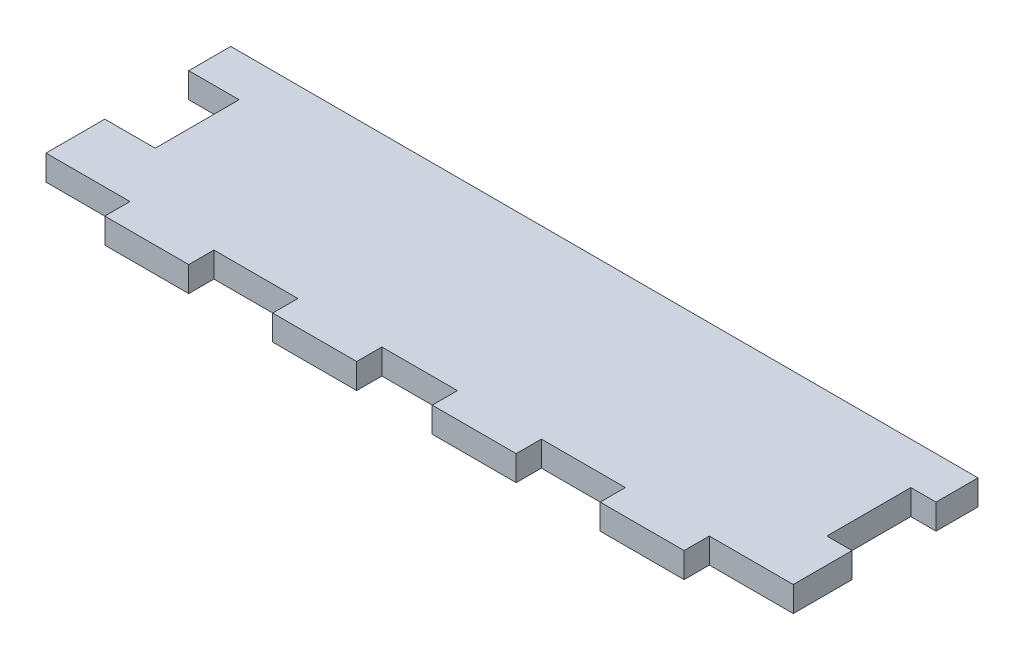
ISO-10303-21;
HEADER;
FILE_DESCRIPTION(('STEP AP214'),'2;1');
FILE_NAME('part.step','',(''),(''),'','','');
FILE_SCHEMA(('AUTOMOTIVE_DESIGN { 1 0 10303 214 1 1 1 1 }'));
ENDSEC;
DATA;
#1=APPLICATION_CONTEXT('core data for automotive mechanical design processes');
#2=APPLICATION_PROTOCOL_DEFINITION('international standard','automotive_design',2000,#1);
#3=PRODUCT_CONTEXT('',#1,'mechanical');
#4=PRODUCT('Part','Part','',(#3));
#5=PRODUCT_RELATED_PRODUCT_CATEGORY('part','',(#4));
#6=PRODUCT_DEFINITION_FORMATION('','',#4);
#7=PRODUCT_DEFINITION_CONTEXT('part definition',#1,'design');
#8=PRODUCT_DEFINITION('design','',#6,#7);
#9=PRODUCT_DEFINITION_SHAPE('','',#8);
#10=(LENGTH_UNIT() NAMED_UNIT(*) SI_UNIT(.MILLI.,.METRE.));
#11=(NAMED_UNIT(*) PLANE_ANGLE_UNIT() SI_UNIT($,.RADIAN.));
#12=(NAMED_UNIT(*) SI_UNIT($,.STERADIAN.) SOLID_ANGLE_UNIT());
#13=UNCERTAINTY_MEASURE_WITH_UNIT(LENGTH_MEASURE(1.E-05),#10,'distance_accuracy_value','');
#14=(GEOMETRIC_REPRESENTATION_CONTEXT(3) GLOBAL_UNCERTAINTY_ASSIGNED_CONTEXT((#13)) GLOBAL_UNIT_ASSIGNED_CONTEXT((#10,
#11,#12)) REPRESENTATION_CONTEXT('',''));
#15=CARTESIAN_POINT('',(0.,0.,0.));
#16=DIRECTION('',(0.,0.,1.));
#17=DIRECTION('',(1.,0.,0.));
#18=AXIS2_PLACEMENT_3D('',#15,#16,#17);
#19=CARTESIAN_POINT('',(0.,3.,0.));
#20=DIRECTION('',(1.,0.,0.));
#21=DIRECTION('',(0.,0.,-1.));
#22=AXIS2_PLACEMENT_3D('',#19,#20,#21);
#23=PLANE('',#22);
#24=DIRECTION('',(0.,0.,1.));
#25=VECTOR('',#24,1.);
#26=CARTESIAN_POINT('',(0.,0.,0.));
#27=LINE('',#26,#25);
#28=CARTESIAN_POINT('',(0.,0.,-7.));
#29=VERTEX_POINT('',#28);
#30=CARTESIAN_POINT('',(0.,0.,0.));
#31=VERTEX_POINT('',#30);
#32=EDGE_CURVE('E248',#29,#31,#27,.T.);
#33=ORIENTED_EDGE('',*,*,#32,.T.);
#34=DIRECTION('',(0.,-1.,0.));
#35=VECTOR('',#34,1.);
#36=CARTESIAN_POINT('',(0.,3.,0.));
#37=LINE('',#36,#35);
#38=CARTESIAN_POINT('',(0.,3.,0.));
#39=VERTEX_POINT('',#38);
#40=EDGE_CURVE('E11',#39,#31,#37,.T.);
#41=ORIENTED_EDGE('',*,*,#40,.F.);
#42=DIRECTION('',(0.,0.,1.));
#43=VECTOR('',#42,1.);
#44=CARTESIAN_POINT('',(0.,3.,0.));
#45=LINE('',#44,#43);
#46=CARTESIAN_POINT('',(0.,3.,-7.));
#47=VERTEX_POINT('',#46);
#48=EDGE_CURVE('E302',#47,#39,#45,.T.);
#49=ORIENTED_EDGE('',*,*,#48,.F.);
#50=DIRECTION('',(0.,-1.,0.));
#51=VECTOR('',#50,1.);
#52=CARTESIAN_POINT('',(0.,3.,-7.));
#53=LINE('',#52,#51);
#54=EDGE_CURVE('E244',#47,#29,#53,.T.);
#55=ORIENTED_EDGE('',*,*,#54,.T.);
#56=EDGE_LOOP('',(#33,#41,#49,#55));
#57=FACE_BOUND('',#56,.T.);
#58=ADVANCED_FACE('F32',(#57),#23,.F.);
#59=CARTESIAN_POINT('',(0.,3.,0.));
#60=DIRECTION('',(0.,0.,-1.));
#61=DIRECTION('',(-1.,0.,0.));
#62=AXIS2_PLACEMENT_3D('',#59,#60,#61);
#63=PLANE('',#62);
#64=DIRECTION('',(1.,0.,0.));
#65=VECTOR('',#64,1.);
#66=CARTESIAN_POINT('',(0.,0.,0.));
#67=LINE('',#66,#65);
#68=CARTESIAN_POINT('',(10.,0.,0.));
#69=VERTEX_POINT('',#68);
#70=EDGE_CURVE('E251',#31,#69,#67,.T.);
#71=ORIENTED_EDGE('',*,*,#70,.T.);
#72=DIRECTION('',(0.,-1.,0.));
#73=VECTOR('',#72,1.);
#74=CARTESIAN_POINT('',(10.,3.,0.));
#75=LINE('',#74,#73);
#76=CARTESIAN_POINT('',(10.,3.,0.));
#77=VERTEX_POINT('',#76);
#78=EDGE_CURVE('E40',#77,#69,#75,.T.);
#79=ORIENTED_EDGE('',*,*,#78,.F.);
#80=DIRECTION('',(1.,0.,0.));
#81=VECTOR('',#80,1.);
#82=CARTESIAN_POINT('',(0.,3.,0.));
#83=LINE('',#82,#81);
#84=EDGE_CURVE('E151',#39,#77,#83,.T.);
#85=ORIENTED_EDGE('',*,*,#84,.F.);
#86=ORIENTED_EDGE('',*,*,#40,.T.);
#87=EDGE_LOOP('',(#71,#79,#85,#86));
#88=FACE_BOUND('',#87,.T.);
#89=ADVANCED_FACE('F460',(#88),#63,.F.);
#90=CARTESIAN_POINT('',(10.,3.,0.));
#91=DIRECTION('',(1.,0.,0.));
#92=DIRECTION('',(0.,0.,-1.));
#93=AXIS2_PLACEMENT_3D('',#90,#91,#92);
#94=PLANE('',#93);
#95=DIRECTION('',(0.,0.,1.));
#96=VECTOR('',#95,1.);
#97=CARTESIAN_POINT('',(10.,0.,0.));
#98=LINE('',#97,#96);
#99=CARTESIAN_POINT('',(10.,0.,3.));
#100=VERTEX_POINT('',#99);
#101=EDGE_CURVE('E253',#69,#100,#98,.T.);
#102=ORIENTED_EDGE('',*,*,#101,.T.);
#103=DIRECTION('',(0.,-1.,0.));
#104=VECTOR('',#103,1.);
#105=CARTESIAN_POINT('',(10.,3.,3.));
#106=LINE('',#105,#104);
#107=CARTESIAN_POINT('',(10.,3.,3.));
#108=VERTEX_POINT('',#107);
#109=EDGE_CURVE('E369',#108,#100,#106,.T.);
#110=ORIENTED_EDGE('',*,*,#109,.F.);
#111=DIRECTION('',(0.,0.,1.));
#112=VECTOR('',#111,1.);
#113=CARTESIAN_POINT('',(10.,3.,0.));
#114=LINE('',#113,#112);
#115=EDGE_CURVE('E377',#77,#108,#114,.T.);
#116=ORIENTED_EDGE('',*,*,#115,.F.);
#117=ORIENTED_EDGE('',*,*,#78,.T.);
#118=EDGE_LOOP('',(#102,#110,#116,#117));
#119=FACE_BOUND('',#118,.T.);
#120=ADVANCED_FACE('F375',(#119),#94,.F.);
#121=CARTESIAN_POINT('',(10.,3.,3.));
#122=DIRECTION('',(0.,0.,-1.));
#123=DIRECTION('',(-1.,0.,0.));
#124=AXIS2_PLACEMENT_3D('',#121,#122,#123);
#125=PLANE('',#124);
#126=DIRECTION('',(1.,0.,0.));
#127=VECTOR('',#126,1.);
#128=CARTESIAN_POINT('',(10.,0.,3.));
#129=LINE('',#128,#127);
#130=CARTESIAN_POINT('',(20.,0.,3.));
#131=VERTEX_POINT('',#130);
#132=EDGE_CURVE('E255',#100,#131,#129,.T.);
#133=ORIENTED_EDGE('',*,*,#132,.T.);
#134=DIRECTION('',(0.,-1.,0.));
#135=VECTOR('',#134,1.);
#136=CARTESIAN_POINT('',(20.,3.,3.));
#137=LINE('',#136,#135);
#138=CARTESIAN_POINT('',(20.,3.,3.));
#139=VERTEX_POINT('',#138);
#140=EDGE_CURVE('E366',#139,#131,#137,.T.);
#141=ORIENTED_EDGE('',*,*,#140,.F.);
#142=DIRECTION('',(1.,0.,0.));
#143=VECTOR('',#142,1.);
#144=CARTESIAN_POINT('',(10.,3.,3.));
#145=LINE('',#144,#143);
#146=EDGE_CURVE('E395',#108,#139,#145,.T.);
#147=ORIENTED_EDGE('',*,*,#146,.F.);
#148=ORIENTED_EDGE('',*,*,#109,.T.);
#149=EDGE_LOOP('',(#133,#141,#147,#148));
#150=FACE_BOUND('',#149,.T.);
#151=ADVANCED_FACE('F386',(#150),#125,.F.);
#152=CARTESIAN_POINT('',(20.,3.,0.));
#153=DIRECTION('',(-1.,0.,0.));
#154=DIRECTION('',(0.,0.,1.));
#155=AXIS2_PLACEMENT_3D('',#152,#153,#154);
#156=PLANE('',#155);
#157=DIRECTION('',(0.,0.,-1.));
#158=VECTOR('',#157,1.);
#159=CARTESIAN_POINT('',(20.,0.,0.));
#160=LINE('',#159,#158);
#161=CARTESIAN_POINT('',(20.,0.,0.));
#162=VERTEX_POINT('',#161);
#163=EDGE_CURVE('E257',#131,#162,#160,.T.);
#164=ORIENTED_EDGE('',*,*,#163,.T.);
#165=DIRECTION('',(0.,-1.,0.));
#166=VECTOR('',#165,1.);
#167=CARTESIAN_POINT('',(20.,3.,0.));
#168=LINE('',#167,#166);
#169=CARTESIAN_POINT('',(20.,3.,0.));
#170=VERTEX_POINT('',#169);
#171=EDGE_CURVE('E363',#170,#162,#168,.T.);
#172=ORIENTED_EDGE('',*,*,#171,.F.);
#173=DIRECTION('',(0.,0.,-1.));
#174=VECTOR('',#173,1.);
#175=CARTESIAN_POINT('',(20.,3.,0.));
#176=LINE('',#175,#174);
#177=EDGE_CURVE('E392',#139,#170,#176,.T.);
#178=ORIENTED_EDGE('',*,*,#177,.F.);
#179=ORIENTED_EDGE('',*,*,#140,.T.);
#180=EDGE_LOOP('',(#164,#172,#178,#179));
#181=FACE_BOUND('',#180,.T.);
#182=ADVANCED_FACE('F390',(#181),#156,.F.);
#183=CARTESIAN_POINT('',(20.,3.,0.));
#184=DIRECTION('',(0.,0.,-1.));
#185=DIRECTION('',(-1.,0.,0.));
#186=AXIS2_PLACEMENT_3D('',#183,#184,#185);
#187=PLANE('',#186);
#188=DIRECTION('',(1.,0.,0.));
#189=VECTOR('',#188,1.);
#190=CARTESIAN_POINT('',(20.,0.,0.));
#191=LINE('',#190,#189);
#192=CARTESIAN_POINT('',(30.,0.,0.));
#193=VERTEX_POINT('',#192);
#194=EDGE_CURVE('E259',#162,#193,#191,.T.);
#195=ORIENTED_EDGE('',*,*,#194,.T.);
#196=DIRECTION('',(0.,-1.,0.));
#197=VECTOR('',#196,1.);
#198=CARTESIAN_POINT('',(30.,3.,0.));
#199=LINE('',#198,#197);
#200=CARTESIAN_POINT('',(30.,3.,0.));
#201=VERTEX_POINT('',#200);
#202=EDGE_CURVE('E360',#201,#193,#199,.T.);
#203=ORIENTED_EDGE('',*,*,#202,.F.);
#204=DIRECTION('',(1.,0.,0.));
#205=VECTOR('',#204,1.);
#206=CARTESIAN_POINT('',(20.,3.,0.));
#207=LINE('',#206,#205);
#208=EDGE_CURVE('E394',#170,#201,#207,.T.);
#209=ORIENTED_EDGE('',*,*,#208,.F.);
#210=ORIENTED_EDGE('',*,*,#171,.T.);
#211=EDGE_LOOP('',(#195,#203,#209,#210));
#212=FACE_BOUND('',#211,.T.);
#213=ADVANCED_FACE('F473',(#212),#187,.F.);
#214=CARTESIAN_POINT('',(30.,3.,0.));
#215=DIRECTION('',(1.,0.,0.));
#216=DIRECTION('',(0.,0.,-1.));
#217=AXIS2_PLACEMENT_3D('',#214,#215,#216);
#218=PLANE('',#217);
#219=DIRECTION('',(0.,0.,1.));
#220=VECTOR('',#219,1.);
#221=CARTESIAN_POINT('',(30.,0.,0.));
#222=LINE('',#221,#220);
#223=CARTESIAN_POINT('',(30.,0.,3.));
#224=VERTEX_POINT('',#223);
#225=EDGE_CURVE('E261',#193,#224,#222,.T.);
#226=ORIENTED_EDGE('',*,*,#225,.T.);
#227=DIRECTION('',(0.,-1.,0.));
#228=VECTOR('',#227,1.);
#229=CARTESIAN_POINT('',(30.,3.,3.));
#230=LINE('',#229,#228);
#231=CARTESIAN_POINT('',(30.,3.,3.));
#232=VERTEX_POINT('',#231);
#233=EDGE_CURVE('E357',#232,#224,#230,.T.);
#234=ORIENTED_EDGE('',*,*,#233,.F.);
#235=DIRECTION('',(0.,0.,1.));
#236=VECTOR('',#235,1.);
#237=CARTESIAN_POINT('',(30.,3.,0.));
#238=LINE('',#237,#236);
#239=EDGE_CURVE('E397',#201,#232,#238,.T.);
#240=ORIENTED_EDGE('',*,*,#239,.F.);
#241=ORIENTED_EDGE('',*,*,#202,.T.);
#242=EDGE_LOOP('',(#226,#234,#240,#241));
#243=FACE_BOUND('',#242,.T.);
#244=ADVANCED_FACE('F476',(#243),#218,.F.);
#245=CARTESIAN_POINT('',(30.,3.,3.));
#246=DIRECTION('',(0.,0.,-1.));
#247=DIRECTION('',(-1.,0.,0.));
#248=AXIS2_PLACEMENT_3D('',#245,#246,#247);
#249=PLANE('',#248);
#250=DIRECTION('',(1.,0.,0.));
#251=VECTOR('',#250,1.);
#252=CARTESIAN_POINT('',(30.,0.,3.));
#253=LINE('',#252,#251);
#254=CARTESIAN_POINT('',(40.,0.,3.));
#255=VERTEX_POINT('',#254);
#256=EDGE_CURVE('E263',#224,#255,#253,.T.);
#257=ORIENTED_EDGE('',*,*,#256,.T.);
#258=DIRECTION('',(0.,-1.,0.));
#259=VECTOR('',#258,1.);
#260=CARTESIAN_POINT('',(40.,3.,3.));
#261=LINE('',#260,#259);
#262=CARTESIAN_POINT('',(40.,3.,3.));
#263=VERTEX_POINT('',#262);
#264=EDGE_CURVE('E354',#263,#255,#261,.T.);
#265=ORIENTED_EDGE('',*,*,#264,.F.);
#266=DIRECTION('',(1.,0.,0.));
#267=VECTOR('',#266,1.);
#268=CARTESIAN_POINT('',(30.,3.,3.));
#269=LINE('',#268,#267);
#270=EDGE_CURVE('E403',#232,#263,#269,.T.);
#271=ORIENTED_EDGE('',*,*,#270,.F.);
#272=ORIENTED_EDGE('',*,*,#233,.T.);
#273=EDGE_LOOP('',(#257,#265,#271,#272));
#274=FACE_BOUND('',#273,.T.);
#275=ADVANCED_FACE('F480',(#274),#249,.F.);
#276=CARTESIAN_POINT('',(40.,3.,0.));
#277=DIRECTION('',(-1.,0.,0.));
#278=DIRECTION('',(0.,0.,1.));
#279=AXIS2_PLACEMENT_3D('',#276,#277,#278);
#280=PLANE('',#279);
#281=DIRECTION('',(0.,0.,-1.));
#282=VECTOR('',#281,1.);
#283=CARTESIAN_POINT('',(40.,0.,0.));
#284=LINE('',#283,#282);
#285=CARTESIAN_POINT('',(40.,0.,0.));
#286=VERTEX_POINT('',#285);
#287=EDGE_CURVE('E265',#255,#286,#284,.T.);
#288=ORIENTED_EDGE('',*,*,#287,.T.);
#289=DIRECTION('',(0.,-1.,0.));
#290=VECTOR('',#289,1.);
#291=CARTESIAN_POINT('',(40.,3.,0.));
#292=LINE('',#291,#290);
#293=CARTESIAN_POINT('',(40.,3.,0.));
#294=VERTEX_POINT('',#293);
#295=EDGE_CURVE('E351',#294,#286,#292,.T.);
#296=ORIENTED_EDGE('',*,*,#295,.F.);
#297=DIRECTION('',(0.,0.,-1.));
#298=VECTOR('',#297,1.);
#299=CARTESIAN_POINT('',(40.,3.,0.));
#300=LINE('',#299,#298);
#301=EDGE_CURVE('E405',#263,#294,#300,.T.);
#302=ORIENTED_EDGE('',*,*,#301,.F.);
#303=ORIENTED_EDGE('',*,*,#264,.T.);
#304=EDGE_LOOP('',(#288,#296,#302,#303));
#305=FACE_BOUND('',#304,.T.);
#306=ADVANCED_FACE('F484',(#305),#280,.F.);
#307=CARTESIAN_POINT('',(40.,3.,0.));
#308=DIRECTION('',(0.,0.,-1.));
#309=DIRECTION('',(-1.,0.,0.));
#310=AXIS2_PLACEMENT_3D('',#307,#308,#309);
#311=PLANE('',#310);
#312=DIRECTION('',(1.,0.,0.));
#313=VECTOR('',#312,1.);
#314=CARTESIAN_POINT('',(40.,0.,0.));
#315=LINE('',#314,#313);
#316=CARTESIAN_POINT('',(49.,0.,0.));
#317=VERTEX_POINT('',#316);
#318=EDGE_CURVE('E267',#286,#317,#315,.T.);
#319=ORIENTED_EDGE('',*,*,#318,.T.);
#320=DIRECTION('',(0.,-1.,0.));
#321=VECTOR('',#320,1.);
#322=CARTESIAN_POINT('',(49.,3.,0.));
#323=LINE('',#322,#321);
#324=CARTESIAN_POINT('',(49.,3.,0.));
#325=VERTEX_POINT('',#324);
#326=EDGE_CURVE('E348',#325,#317,#323,.T.);
#327=ORIENTED_EDGE('',*,*,#326,.F.);
#328=DIRECTION('',(1.,0.,0.));
#329=VECTOR('',#328,1.);
#330=CARTESIAN_POINT('',(40.,3.,0.));
#331=LINE('',#330,#329);
#332=EDGE_CURVE('E407',#294,#325,#331,.T.);
#333=ORIENTED_EDGE('',*,*,#332,.F.);
#334=ORIENTED_EDGE('',*,*,#295,.T.);
#335=EDGE_LOOP('',(#319,#327,#333,#334));
#336=FACE_BOUND('',#335,.T.);
#337=ADVANCED_FACE('F488',(#336),#311,.F.);
#338=CARTESIAN_POINT('',(49.,3.,0.));
#339=DIRECTION('',(1.,0.,0.));
#340=DIRECTION('',(0.,0.,-1.));
#341=AXIS2_PLACEMENT_3D('',#338,#339,#340);
#342=PLANE('',#341);
#343=DIRECTION('',(0.,0.,1.));
#344=VECTOR('',#343,1.);
#345=CARTESIAN_POINT('',(49.,0.,0.));
#346=LINE('',#345,#344);
#347=CARTESIAN_POINT('',(49.,0.,3.));
#348=VERTEX_POINT('',#347);
#349=EDGE_CURVE('E269',#317,#348,#346,.T.);
#350=ORIENTED_EDGE('',*,*,#349,.T.);
#351=DIRECTION('',(0.,-1.,0.));
#352=VECTOR('',#351,1.);
#353=CARTESIAN_POINT('',(49.,3.,3.));
#354=LINE('',#353,#352);
#355=CARTESIAN_POINT('',(49.,3.,3.));
#356=VERTEX_POINT('',#355);
#357=EDGE_CURVE('E345',#356,#348,#354,.T.);
#358=ORIENTED_EDGE('',*,*,#357,.F.);
#359=DIRECTION('',(0.,0.,1.));
#360=VECTOR('',#359,1.);
#361=CARTESIAN_POINT('',(49.,3.,0.));
#362=LINE('',#361,#360);
#363=EDGE_CURVE('E409',#325,#356,#362,.T.);
#364=ORIENTED_EDGE('',*,*,#363,.F.);
#365=ORIENTED_EDGE('',*,*,#326,.T.);
#366=EDGE_LOOP('',(#350,#358,#364,#365));
#367=FACE_BOUND('',#366,.T.);
#368=ADVANCED_FACE('F492',(#367),#342,.F.);
#369=CARTESIAN_POINT('',(49.,3.,3.));
#370=DIRECTION('',(0.,0.,-1.));
#371=DIRECTION('',(-1.,0.,0.));
#372=AXIS2_PLACEMENT_3D('',#369,#370,#371);
#373=PLANE('',#372);
#374=DIRECTION('',(1.,0.,0.));
#375=VECTOR('',#374,1.);
#376=CARTESIAN_POINT('',(49.,0.,3.));
#377=LINE('',#376,#375);
#378=CARTESIAN_POINT('',(59.,0.,3.));
#379=VERTEX_POINT('',#378);
#380=EDGE_CURVE('E271',#348,#379,#377,.T.);
#381=ORIENTED_EDGE('',*,*,#380,.T.);
#382=DIRECTION('',(0.,-1.,0.));
#383=VECTOR('',#382,1.);
#384=CARTESIAN_POINT('',(59.,3.,3.));
#385=LINE('',#384,#383);
#386=CARTESIAN_POINT('',(59.,3.,3.));
#387=VERTEX_POINT('',#386);
#388=EDGE_CURVE('E342',#387,#379,#385,.T.);
#389=ORIENTED_EDGE('',*,*,#388,.F.);
#390=DIRECTION('',(1.,0.,0.));
#391=VECTOR('',#390,1.);
#392=CARTESIAN_POINT('',(49.,3.,3.));
#393=LINE('',#392,#391);
#394=EDGE_CURVE('E411',#356,#387,#393,.T.);
#395=ORIENTED_EDGE('',*,*,#394,.F.);
#396=ORIENTED_EDGE('',*,*,#357,.T.);
#397=EDGE_LOOP('',(#381,#389,#395,#396));
#398=FACE_BOUND('',#397,.T.);
#399=ADVANCED_FACE('F496',(#398),#373,.F.);
#400=CARTESIAN_POINT('',(59.,3.,0.));
#401=DIRECTION('',(-1.,0.,0.));
#402=DIRECTION('',(0.,0.,1.));
#403=AXIS2_PLACEMENT_3D('',#400,#401,#402);
#404=PLANE('',#403);
#405=DIRECTION('',(0.,0.,-1.));
#406=VECTOR('',#405,1.);
#407=CARTESIAN_POINT('',(59.,0.,0.));
#408=LINE('',#407,#406);
#409=CARTESIAN_POINT('',(59.,0.,0.));
#410=VERTEX_POINT('',#409);
#411=EDGE_CURVE('E273',#379,#410,#408,.T.);
#412=ORIENTED_EDGE('',*,*,#411,.T.);
#413=DIRECTION('',(0.,-1.,0.));
#414=VECTOR('',#413,1.);
#415=CARTESIAN_POINT('',(59.,3.,0.));
#416=LINE('',#415,#414);
#417=CARTESIAN_POINT('',(59.,3.,0.));
#418=VERTEX_POINT('',#417);
#419=EDGE_CURVE('E339',#418,#410,#416,.T.);
#420=ORIENTED_EDGE('',*,*,#419,.F.);
#421=DIRECTION('',(0.,0.,-1.));
#422=VECTOR('',#421,1.);
#423=CARTESIAN_POINT('',(59.,3.,0.));
#424=LINE('',#423,#422);
#425=EDGE_CURVE('E413',#387,#418,#424,.T.);
#426=ORIENTED_EDGE('',*,*,#425,.F.);
#427=ORIENTED_EDGE('',*,*,#388,.T.);
#428=EDGE_LOOP('',(#412,#420,#426,#427));
#429=FACE_BOUND('',#428,.T.);
#430=ADVANCED_FACE('F500',(#429),#404,.F.);
#431=CARTESIAN_POINT('',(59.,3.,0.));
#432=DIRECTION('',(0.,0.,-1.));
#433=DIRECTION('',(-1.,0.,0.));
#434=AXIS2_PLACEMENT_3D('',#431,#432,#433);
#435=PLANE('',#434);
#436=DIRECTION('',(1.,0.,0.));
#437=VECTOR('',#436,1.);
#438=CARTESIAN_POINT('',(59.,0.,0.));
#439=LINE('',#438,#437);
#440=CARTESIAN_POINT('',(69.,0.,0.));
#441=VERTEX_POINT('',#440);
#442=EDGE_CURVE('E275',#410,#441,#439,.T.);
#443=ORIENTED_EDGE('',*,*,#442,.T.);
#444=DIRECTION('',(0.,-1.,0.));
#445=VECTOR('',#444,1.);
#446=CARTESIAN_POINT('',(69.,3.,0.));
#447=LINE('',#446,#445);
#448=CARTESIAN_POINT('',(69.,3.,0.));
#449=VERTEX_POINT('',#448);
#450=EDGE_CURVE('E336',#449,#441,#447,.T.);
#451=ORIENTED_EDGE('',*,*,#450,.F.);
#452=DIRECTION('',(1.,0.,0.));
#453=VECTOR('',#452,1.);
#454=CARTESIAN_POINT('',(59.,3.,0.));
#455=LINE('',#454,#453);
#456=EDGE_CURVE('E415',#418,#449,#455,.T.);
#457=ORIENTED_EDGE('',*,*,#456,.F.);
#458=ORIENTED_EDGE('',*,*,#419,.T.);
#459=EDGE_LOOP('',(#443,#451,#457,#458));
#460=FACE_BOUND('',#459,.T.);
#461=ADVANCED_FACE('F504',(#460),#435,.F.);
#462=CARTESIAN_POINT('',(69.,3.,0.));
#463=DIRECTION('',(1.,0.,0.));
#464=DIRECTION('',(0.,0.,-1.));
#465=AXIS2_PLACEMENT_3D('',#462,#463,#464);
#466=PLANE('',#465);
#467=DIRECTION('',(0.,0.,1.));
#468=VECTOR('',#467,1.);
#469=CARTESIAN_POINT('',(69.,0.,0.));
#470=LINE('',#469,#468);
#471=CARTESIAN_POINT('',(69.,0.,3.));
#472=VERTEX_POINT('',#471);
#473=EDGE_CURVE('E277',#441,#472,#470,.T.);
#474=ORIENTED_EDGE('',*,*,#473,.T.);
#475=DIRECTION('',(0.,-1.,0.));
#476=VECTOR('',#475,1.);
#477=CARTESIAN_POINT('',(69.,3.,3.));
#478=LINE('',#477,#476);
#479=CARTESIAN_POINT('',(69.,3.,3.));
#480=VERTEX_POINT('',#479);
#481=EDGE_CURVE('E333',#480,#472,#478,.T.);
#482=ORIENTED_EDGE('',*,*,#481,.F.);
#483=DIRECTION('',(0.,0.,1.));
#484=VECTOR('',#483,1.);
#485=CARTESIAN_POINT('',(69.,3.,0.));
#486=LINE('',#485,#484);
#487=EDGE_CURVE('E417',#449,#480,#486,.T.);
#488=ORIENTED_EDGE('',*,*,#487,.F.);
#489=ORIENTED_EDGE('',*,*,#450,.T.);
#490=EDGE_LOOP('',(#474,#482,#488,#489));
#491=FACE_BOUND('',#490,.T.);
#492=ADVANCED_FACE('F508',(#491),#466,.F.);
#493=CARTESIAN_POINT('',(69.,3.,3.));
#494=DIRECTION('',(0.,0.,-1.));
#495=DIRECTION('',(-1.,0.,0.));
#496=AXIS2_PLACEMENT_3D('',#493,#494,#495);
#497=PLANE('',#496);
#498=DIRECTION('',(1.,0.,0.));
#499=VECTOR('',#498,1.);
#500=CARTESIAN_POINT('',(69.,0.,3.));
#501=LINE('',#500,#499);
#502=CARTESIAN_POINT('',(79.,0.,3.));
#503=VERTEX_POINT('',#502);
#504=EDGE_CURVE('E279',#472,#503,#501,.T.);
#505=ORIENTED_EDGE('',*,*,#504,.T.);
#506=DIRECTION('',(0.,-1.,0.));
#507=VECTOR('',#506,1.);
#508=CARTESIAN_POINT('',(79.,3.,3.));
#509=LINE('',#508,#507);
#510=CARTESIAN_POINT('',(79.,3.,3.));
#511=VERTEX_POINT('',#510);
#512=EDGE_CURVE('E330',#511,#503,#509,.T.);
#513=ORIENTED_EDGE('',*,*,#512,.F.);
#514=DIRECTION('',(1.,0.,0.));
#515=VECTOR('',#514,1.);
#516=CARTESIAN_POINT('',(69.,3.,3.));
#517=LINE('',#516,#515);
#518=EDGE_CURVE('E419',#480,#511,#517,.T.);
#519=ORIENTED_EDGE('',*,*,#518,.F.);
#520=ORIENTED_EDGE('',*,*,#481,.T.);
#521=EDGE_LOOP('',(#505,#513,#519,#520));
#522=FACE_BOUND('',#521,.T.);
#523=ADVANCED_FACE('F512',(#522),#497,.F.);
#524=CARTESIAN_POINT('',(79.,3.,0.));
#525=DIRECTION('',(-1.,0.,0.));
#526=DIRECTION('',(0.,0.,1.));
#527=AXIS2_PLACEMENT_3D('',#524,#525,#526);
#528=PLANE('',#527);
#529=DIRECTION('',(0.,0.,-1.));
#530=VECTOR('',#529,1.);
#531=CARTESIAN_POINT('',(79.,0.,0.));
#532=LINE('',#531,#530);
#533=CARTESIAN_POINT('',(79.,0.,0.));
#534=VERTEX_POINT('',#533);
#535=EDGE_CURVE('E281',#503,#534,#532,.T.);
#536=ORIENTED_EDGE('',*,*,#535,.T.);
#537=DIRECTION('',(0.,-1.,0.));
#538=VECTOR('',#537,1.);
#539=CARTESIAN_POINT('',(79.,3.,0.));
#540=LINE('',#539,#538);
#541=CARTESIAN_POINT('',(79.,3.,0.));
#542=VERTEX_POINT('',#541);
#543=EDGE_CURVE('E327',#542,#534,#540,.T.);
#544=ORIENTED_EDGE('',*,*,#543,.F.);
#545=DIRECTION('',(0.,0.,-1.));
#546=VECTOR('',#545,1.);
#547=CARTESIAN_POINT('',(79.,3.,0.));
#548=LINE('',#547,#546);
#549=EDGE_CURVE('E421',#511,#542,#548,.T.);
#550=ORIENTED_EDGE('',*,*,#549,.F.);
#551=ORIENTED_EDGE('',*,*,#512,.T.);
#552=EDGE_LOOP('',(#536,#544,#550,#551));
#553=FACE_BOUND('',#552,.T.);
#554=ADVANCED_FACE('F516',(#553),#528,.F.);
#555=CARTESIAN_POINT('',(79.,3.,0.));
#556=DIRECTION('',(0.,0.,-1.));
#557=DIRECTION('',(-1.,0.,0.));
#558=AXIS2_PLACEMENT_3D('',#555,#556,#557);
#559=PLANE('',#558);
#560=DIRECTION('',(1.,0.,0.));
#561=VECTOR('',#560,1.);
#562=CARTESIAN_POINT('',(79.,0.,0.));
#563=LINE('',#562,#561);
#564=CARTESIAN_POINT('',(89.,0.,0.));
#565=VERTEX_POINT('',#564);
#566=EDGE_CURVE('E283',#534,#565,#563,.T.);
#567=ORIENTED_EDGE('',*,*,#566,.T.);
#568=DIRECTION('',(0.,-1.,0.));
#569=VECTOR('',#568,1.);
#570=CARTESIAN_POINT('',(89.,3.,0.));
#571=LINE('',#570,#569);
#572=CARTESIAN_POINT('',(89.,3.,0.));
#573=VERTEX_POINT('',#572);
#574=EDGE_CURVE('E324',#573,#565,#571,.T.);
#575=ORIENTED_EDGE('',*,*,#574,.F.);
#576=DIRECTION('',(1.,0.,0.));
#577=VECTOR('',#576,1.);
#578=CARTESIAN_POINT('',(79.,3.,0.));
#579=LINE('',#578,#577);
#580=EDGE_CURVE('E423',#542,#573,#579,.T.);
#581=ORIENTED_EDGE('',*,*,#580,.F.);
#582=ORIENTED_EDGE('',*,*,#543,.T.);
#583=EDGE_LOOP('',(#567,#575,#581,#582));
#584=FACE_BOUND('',#583,.T.);
#585=ADVANCED_FACE('F520',(#584),#559,.F.);
#586=CARTESIAN_POINT('',(89.,3.,0.));
#587=DIRECTION('',(-1.,0.,0.));
#588=DIRECTION('',(0.,0.,1.));
#589=AXIS2_PLACEMENT_3D('',#586,#587,#588);
#590=PLANE('',#589);
#591=DIRECTION('',(0.,0.,-1.));
#592=VECTOR('',#591,1.);
#593=CARTESIAN_POINT('',(89.,0.,0.));
#594=LINE('',#593,#592);
#595=CARTESIAN_POINT('',(89.,0.,-7.));
#596=VERTEX_POINT('',#595);
#597=EDGE_CURVE('E285',#565,#596,#594,.T.);
#598=ORIENTED_EDGE('',*,*,#597,.T.);
#599=DIRECTION('',(0.,-1.,0.));
#600=VECTOR('',#599,1.);
#601=CARTESIAN_POINT('',(89.,3.,-7.));
#602=LINE('',#601,#600);
#603=CARTESIAN_POINT('',(89.,3.,-7.));
#604=VERTEX_POINT('',#603);
#605=EDGE_CURVE('E321',#604,#596,#602,.T.);
#606=ORIENTED_EDGE('',*,*,#605,.F.);
#607=DIRECTION('',(0.,0.,-1.));
#608=VECTOR('',#607,1.);
#609=CARTESIAN_POINT('',(89.,3.,0.));
#610=LINE('',#609,#608);
#611=EDGE_CURVE('E425',#573,#604,#610,.T.);
#612=ORIENTED_EDGE('',*,*,#611,.F.);
#613=ORIENTED_EDGE('',*,*,#574,.T.);
#614=EDGE_LOOP('',(#598,#606,#612,#613));
#615=FACE_BOUND('',#614,.T.);
#616=ADVANCED_FACE('F524',(#615),#590,.F.);
#617=CARTESIAN_POINT('',(89.,3.,-7.));
#618=DIRECTION('',(0.,0.,1.));
#619=DIRECTION('',(1.,0.,0.));
#620=AXIS2_PLACEMENT_3D('',#617,#618,#619);
#621=PLANE('',#620);
#622=DIRECTION('',(-1.,0.,0.));
#623=VECTOR('',#622,1.);
#624=CARTESIAN_POINT('',(89.,0.,-7.));
#625=LINE('',#624,#623);
#626=CARTESIAN_POINT('',(86.,0.,-7.));
#627=VERTEX_POINT('',#626);
#628=EDGE_CURVE('E287',#596,#627,#625,.T.);
#629=ORIENTED_EDGE('',*,*,#628,.T.);
#630=DIRECTION('',(0.,-1.,0.));
#631=VECTOR('',#630,1.);
#632=CARTESIAN_POINT('',(86.,3.,-7.));
#633=LINE('',#632,#631);
#634=CARTESIAN_POINT('',(86.,3.,-7.));
#635=VERTEX_POINT('',#634);
#636=EDGE_CURVE('E318',#635,#627,#633,.T.);
#637=ORIENTED_EDGE('',*,*,#636,.F.);
#638=DIRECTION('',(-1.,0.,0.));
#639=VECTOR('',#638,1.);
#640=CARTESIAN_POINT('',(89.,3.,-7.));
#641=LINE('',#640,#639);
#642=EDGE_CURVE('E427',#604,#635,#641,.T.);
#643=ORIENTED_EDGE('',*,*,#642,.F.);
#644=ORIENTED_EDGE('',*,*,#605,.T.);
#645=EDGE_LOOP('',(#629,#637,#643,#644));
#646=FACE_BOUND('',#645,.T.);
#647=ADVANCED_FACE('F528',(#646),#621,.F.);
#648=CARTESIAN_POINT('',(86.,3.,-17.));
#649=DIRECTION('',(-1.,0.,0.));
#650=DIRECTION('',(0.,0.,1.));
#651=AXIS2_PLACEMENT_3D('',#648,#649,#650);
#652=PLANE('',#651);
#653=DIRECTION('',(0.,0.,-1.));
#654=VECTOR('',#653,1.);
#655=CARTESIAN_POINT('',(86.,0.,-17.));
#656=LINE('',#655,#654);
#657=CARTESIAN_POINT('',(86.,0.,-17.));
#658=VERTEX_POINT('',#657);
#659=EDGE_CURVE('E289',#627,#658,#656,.T.);
#660=ORIENTED_EDGE('',*,*,#659,.T.);
#661=DIRECTION('',(0.,-1.,0.));
#662=VECTOR('',#661,1.);
#663=CARTESIAN_POINT('',(86.,3.,-17.));
#664=LINE('',#663,#662);
#665=CARTESIAN_POINT('',(86.,3.,-17.));
#666=VERTEX_POINT('',#665);
#667=EDGE_CURVE('E315',#666,#658,#664,.T.);
#668=ORIENTED_EDGE('',*,*,#667,.F.);
#669=DIRECTION('',(0.,0.,-1.));
#670=VECTOR('',#669,1.);
#671=CARTESIAN_POINT('',(86.,3.,-17.));
#672=LINE('',#671,#670);
#673=EDGE_CURVE('E429',#635,#666,#672,.T.);
#674=ORIENTED_EDGE('',*,*,#673,.F.);
#675=ORIENTED_EDGE('',*,*,#636,.T.);
#676=EDGE_LOOP('',(#660,#668,#674,#675));
#677=FACE_BOUND('',#676,.T.);
#678=ADVANCED_FACE('F532',(#677),#652,.F.);
#679=CARTESIAN_POINT('',(89.,3.,-17.));
#680=DIRECTION('',(0.,0.,-1.));
#681=DIRECTION('',(-1.,0.,0.));
#682=AXIS2_PLACEMENT_3D('',#679,#680,#681);
#683=PLANE('',#682);
#684=DIRECTION('',(1.,0.,0.));
#685=VECTOR('',#684,1.);
#686=CARTESIAN_POINT('',(89.,0.,-17.));
#687=LINE('',#686,#685);
#688=CARTESIAN_POINT('',(89.,0.,-17.));
#689=VERTEX_POINT('',#688);
#690=EDGE_CURVE('E291',#658,#689,#687,.T.);
#691=ORIENTED_EDGE('',*,*,#690,.T.);
#692=DIRECTION('',(0.,-1.,0.));
#693=VECTOR('',#692,1.);
#694=CARTESIAN_POINT('',(89.,3.,-17.));
#695=LINE('',#694,#693);
#696=CARTESIAN_POINT('',(89.,3.,-17.));
#697=VERTEX_POINT('',#696);
#698=EDGE_CURVE('E312',#697,#689,#695,.T.);
#699=ORIENTED_EDGE('',*,*,#698,.F.);
#700=DIRECTION('',(1.,0.,0.));
#701=VECTOR('',#700,1.);
#702=CARTESIAN_POINT('',(89.,3.,-17.));
#703=LINE('',#702,#701);
#704=EDGE_CURVE('E431',#666,#697,#703,.T.);
#705=ORIENTED_EDGE('',*,*,#704,.F.);
#706=ORIENTED_EDGE('',*,*,#667,.T.);
#707=EDGE_LOOP('',(#691,#699,#705,#706));
#708=FACE_BOUND('',#707,.T.);
#709=ADVANCED_FACE('F536',(#708),#683,.F.);
#710=CARTESIAN_POINT('',(89.,3.,-17.));
#711=DIRECTION('',(-1.,0.,0.));
#712=DIRECTION('',(0.,0.,1.));
#713=AXIS2_PLACEMENT_3D('',#710,#711,#712);
#714=PLANE('',#713);
#715=DIRECTION('',(0.,0.,-1.));
#716=VECTOR('',#715,1.);
#717=CARTESIAN_POINT('',(89.,0.,-17.));
#718=LINE('',#717,#716);
#719=CARTESIAN_POINT('',(89.,0.,-22.));
#720=VERTEX_POINT('',#719);
#721=EDGE_CURVE('E293',#689,#720,#718,.T.);
#722=ORIENTED_EDGE('',*,*,#721,.T.);
#723=DIRECTION('',(0.,-1.,0.));
#724=VECTOR('',#723,1.);
#725=CARTESIAN_POINT('',(89.,3.,-22.));
#726=LINE('',#725,#724);
#727=CARTESIAN_POINT('',(89.,3.,-22.));
#728=VERTEX_POINT('',#727);
#729=EDGE_CURVE('E309',#728,#720,#726,.T.);
#730=ORIENTED_EDGE('',*,*,#729,.F.);
#731=DIRECTION('',(0.,0.,-1.));
#732=VECTOR('',#731,1.);
#733=CARTESIAN_POINT('',(89.,3.,-17.));
#734=LINE('',#733,#732);
#735=EDGE_CURVE('E433',#697,#728,#734,.T.);
#736=ORIENTED_EDGE('',*,*,#735,.F.);
#737=ORIENTED_EDGE('',*,*,#698,.T.);
#738=EDGE_LOOP('',(#722,#730,#736,#737));
#739=FACE_BOUND('',#738,.T.);
#740=ADVANCED_FACE('F540',(#739),#714,.F.);
#741=CARTESIAN_POINT('',(0.,3.,-22.));
#742=DIRECTION('',(0.,0.,1.));
#743=DIRECTION('',(1.,0.,0.));
#744=AXIS2_PLACEMENT_3D('',#741,#742,#743);
#745=PLANE('',#744);
#746=DIRECTION('',(-1.,0.,0.));
#747=VECTOR('',#746,1.);
#748=CARTESIAN_POINT('',(0.,0.,-22.));
#749=LINE('',#748,#747);
#750=CARTESIAN_POINT('',(0.,0.,-22.));
#751=VERTEX_POINT('',#750);
#752=EDGE_CURVE('E295',#720,#751,#749,.T.);
#753=ORIENTED_EDGE('',*,*,#752,.T.);
#754=DIRECTION('',(0.,-1.,0.));
#755=VECTOR('',#754,1.);
#756=CARTESIAN_POINT('',(0.,3.,-22.));
#757=LINE('',#756,#755);
#758=CARTESIAN_POINT('',(0.,3.,-22.));
#759=VERTEX_POINT('',#758);
#760=EDGE_CURVE('E306',#759,#751,#757,.T.);
#761=ORIENTED_EDGE('',*,*,#760,.F.);
#762=DIRECTION('',(-1.,0.,0.));
#763=VECTOR('',#762,1.);
#764=CARTESIAN_POINT('',(0.,3.,-22.));
#765=LINE('',#764,#763);
#766=EDGE_CURVE('E435',#728,#759,#765,.T.);
#767=ORIENTED_EDGE('',*,*,#766,.F.);
#768=ORIENTED_EDGE('',*,*,#729,.T.);
#769=EDGE_LOOP('',(#753,#761,#767,#768));
#770=FACE_BOUND('',#769,.T.);
#771=ADVANCED_FACE('F441',(#770),#745,.F.);
#772=CARTESIAN_POINT('',(0.,3.,-22.));
#773=DIRECTION('',(1.,0.,0.));
#774=DIRECTION('',(0.,0.,-1.));
#775=AXIS2_PLACEMENT_3D('',#772,#773,#774);
#776=PLANE('',#775);
#777=DIRECTION('',(0.,0.,1.));
#778=VECTOR('',#777,1.);
#779=CARTESIAN_POINT('',(0.,0.,-22.));
#780=LINE('',#779,#778);
#781=CARTESIAN_POINT('',(0.,0.,-17.));
#782=VERTEX_POINT('',#781);
#783=EDGE_CURVE('E297',#751,#782,#780,.T.);
#784=ORIENTED_EDGE('',*,*,#783,.T.);
#785=DIRECTION('',(0.,-1.,0.));
#786=VECTOR('',#785,1.);
#787=CARTESIAN_POINT('',(0.,3.,-17.));
#788=LINE('',#787,#786);
#789=CARTESIAN_POINT('',(0.,3.,-17.));
#790=VERTEX_POINT('',#789);
#791=EDGE_CURVE('E239',#790,#782,#788,.T.);
#792=ORIENTED_EDGE('',*,*,#791,.F.);
#793=DIRECTION('',(0.,0.,1.));
#794=VECTOR('',#793,1.);
#795=CARTESIAN_POINT('',(0.,3.,-22.));
#796=LINE('',#795,#794);
#797=EDGE_CURVE('E230',#759,#790,#796,.T.);
#798=ORIENTED_EDGE('',*,*,#797,.F.);
#799=ORIENTED_EDGE('',*,*,#760,.T.);
#800=EDGE_LOOP('',(#784,#792,#798,#799));
#801=FACE_BOUND('',#800,.T.);
#802=ADVANCED_FACE('F445',(#801),#776,.F.);
#803=CARTESIAN_POINT('',(0.,3.,-17.));
#804=DIRECTION('',(0.,0.,-1.));
#805=DIRECTION('',(-1.,0.,0.));
#806=AXIS2_PLACEMENT_3D('',#803,#804,#805);
#807=PLANE('',#806);
#808=DIRECTION('',(1.,0.,0.));
#809=VECTOR('',#808,1.);
#810=CARTESIAN_POINT('',(0.,0.,-17.));
#811=LINE('',#810,#809);
#812=CARTESIAN_POINT('',(6.,0.,-17.));
#813=VERTEX_POINT('',#812);
#814=EDGE_CURVE('E238',#782,#813,#811,.T.);
#815=ORIENTED_EDGE('',*,*,#814,.T.);
#816=DIRECTION('',(0.,-1.,0.));
#817=VECTOR('',#816,1.);
#818=CARTESIAN_POINT('',(6.,3.,-17.));
#819=LINE('',#818,#817);
#820=CARTESIAN_POINT('',(6.,3.,-17.));
#821=VERTEX_POINT('',#820);
#822=EDGE_CURVE('E235',#821,#813,#819,.T.);
#823=ORIENTED_EDGE('',*,*,#822,.F.);
#824=DIRECTION('',(1.,0.,0.));
#825=VECTOR('',#824,1.);
#826=CARTESIAN_POINT('',(0.,3.,-17.));
#827=LINE('',#826,#825);
#828=EDGE_CURVE('E224',#790,#821,#827,.T.);
#829=ORIENTED_EDGE('',*,*,#828,.F.);
#830=ORIENTED_EDGE('',*,*,#791,.T.);
#831=EDGE_LOOP('',(#815,#823,#829,#830));
#832=FACE_BOUND('',#831,.T.);
#833=ADVANCED_FACE('F236',(#832),#807,.F.);
#834=CARTESIAN_POINT('',(6.,3.,-17.));
#835=DIRECTION('',(1.,0.,0.));
#836=DIRECTION('',(0.,0.,-1.));
#837=AXIS2_PLACEMENT_3D('',#834,#835,#836);
#838=PLANE('',#837);
#839=DIRECTION('',(0.,0.,1.));
#840=VECTOR('',#839,1.);
#841=CARTESIAN_POINT('',(6.,0.,-17.));
#842=LINE('',#841,#840);
#843=CARTESIAN_POINT('',(6.,0.,-7.));
#844=VERTEX_POINT('',#843);
#845=EDGE_CURVE('E137',#813,#844,#842,.T.);
#846=ORIENTED_EDGE('',*,*,#845,.T.);
#847=DIRECTION('',(0.,-1.,0.));
#848=VECTOR('',#847,1.);
#849=CARTESIAN_POINT('',(6.,3.,-7.));
#850=LINE('',#849,#848);
#851=CARTESIAN_POINT('',(6.,3.,-7.));
#852=VERTEX_POINT('',#851);
#853=EDGE_CURVE('E240',#852,#844,#850,.T.);
#854=ORIENTED_EDGE('',*,*,#853,.F.);
#855=DIRECTION('',(0.,0.,1.));
#856=VECTOR('',#855,1.);
#857=CARTESIAN_POINT('',(6.,3.,-17.));
#858=LINE('',#857,#856);
#859=EDGE_CURVE('E228',#821,#852,#858,.T.);
#860=ORIENTED_EDGE('',*,*,#859,.F.);
#861=ORIENTED_EDGE('',*,*,#822,.T.);
#862=EDGE_LOOP('',(#846,#854,#860,#861));
#863=FACE_BOUND('',#862,.T.);
#864=ADVANCED_FACE('F242',(#863),#838,.F.);
#865=CARTESIAN_POINT('',(0.,3.,-7.));
#866=DIRECTION('',(0.,0.,1.));
#867=DIRECTION('',(1.,0.,0.));
#868=AXIS2_PLACEMENT_3D('',#865,#866,#867);
#869=PLANE('',#868);
#870=DIRECTION('',(-1.,0.,0.));
#871=VECTOR('',#870,1.);
#872=CARTESIAN_POINT('',(0.,0.,-7.));
#873=LINE('',#872,#871);
#874=EDGE_CURVE('E143',#844,#29,#873,.T.);
#875=ORIENTED_EDGE('',*,*,#874,.T.);
#876=ORIENTED_EDGE('',*,*,#54,.F.);
#877=DIRECTION('',(-1.,0.,0.));
#878=VECTOR('',#877,1.);
#879=CARTESIAN_POINT('',(0.,3.,-7.));
#880=LINE('',#879,#878);
#881=EDGE_CURVE('E48',#852,#47,#880,.T.);
#882=ORIENTED_EDGE('',*,*,#881,.F.);
#883=ORIENTED_EDGE('',*,*,#853,.T.);
#884=EDGE_LOOP('',(#875,#876,#882,#883));
#885=FACE_BOUND('',#884,.T.);
#886=ADVANCED_FACE('F449',(#885),#869,.F.);
#887=CARTESIAN_POINT('',(0.,3.,0.));
#888=DIRECTION('',(0.,-1.,0.));
#889=DIRECTION('',(0.,0.,-1.));
#890=AXIS2_PLACEMENT_3D('',#887,#888,#889);
#891=PLANE('',#890);
#892=ORIENTED_EDGE('',*,*,#48,.T.);
#893=ORIENTED_EDGE('',*,*,#84,.T.);
#894=ORIENTED_EDGE('',*,*,#115,.T.);
#895=ORIENTED_EDGE('',*,*,#146,.T.);
#896=ORIENTED_EDGE('',*,*,#177,.T.);
#897=ORIENTED_EDGE('',*,*,#208,.T.);
#898=ORIENTED_EDGE('',*,*,#239,.T.);
#899=ORIENTED_EDGE('',*,*,#270,.T.);
#900=ORIENTED_EDGE('',*,*,#301,.T.);
#901=ORIENTED_EDGE('',*,*,#332,.T.);
#902=ORIENTED_EDGE('',*,*,#363,.T.);
#903=ORIENTED_EDGE('',*,*,#394,.T.);
#904=ORIENTED_EDGE('',*,*,#425,.T.);
#905=ORIENTED_EDGE('',*,*,#456,.T.);
#906=ORIENTED_EDGE('',*,*,#487,.T.);
#907=ORIENTED_EDGE('',*,*,#518,.T.);
#908=ORIENTED_EDGE('',*,*,#549,.T.);
#909=ORIENTED_EDGE('',*,*,#580,.T.);
#910=ORIENTED_EDGE('',*,*,#611,.T.);
#911=ORIENTED_EDGE('',*,*,#642,.T.);
#912=ORIENTED_EDGE('',*,*,#673,.T.);
#913=ORIENTED_EDGE('',*,*,#704,.T.);
#914=ORIENTED_EDGE('',*,*,#735,.T.);
#915=ORIENTED_EDGE('',*,*,#766,.T.);
#916=ORIENTED_EDGE('',*,*,#797,.T.);
#917=ORIENTED_EDGE('',*,*,#828,.T.);
#918=ORIENTED_EDGE('',*,*,#859,.T.);
#919=ORIENTED_EDGE('',*,*,#881,.T.);
#920=EDGE_LOOP('',(#892,#893,#894,#895,#896,#897,#898,#899,#900,#901,#902,#903,#904,#905,#906,
#907,#908,#909,#910,#911,#912,#913,#914,#915,#916,#917,#918,#919));
#921=FACE_BOUND('',#920,.T.);
#922=ADVANCED_FACE('F226',(#921),#891,.F.);
#923=CARTESIAN_POINT('',(0.,0.,0.));
#924=DIRECTION('',(0.,-1.,0.));
#925=DIRECTION('',(0.,0.,-1.));
#926=AXIS2_PLACEMENT_3D('',#923,#924,#925);
#927=PLANE('',#926);
#928=ORIENTED_EDGE('',*,*,#32,.F.);
#929=ORIENTED_EDGE('',*,*,#874,.F.);
#930=ORIENTED_EDGE('',*,*,#845,.F.);
#931=ORIENTED_EDGE('',*,*,#814,.F.);
#932=ORIENTED_EDGE('',*,*,#783,.F.);
#933=ORIENTED_EDGE('',*,*,#752,.F.);
#934=ORIENTED_EDGE('',*,*,#721,.F.);
#935=ORIENTED_EDGE('',*,*,#690,.F.);
#936=ORIENTED_EDGE('',*,*,#659,.F.);
#937=ORIENTED_EDGE('',*,*,#628,.F.);
#938=ORIENTED_EDGE('',*,*,#597,.F.);
#939=ORIENTED_EDGE('',*,*,#566,.F.);
#940=ORIENTED_EDGE('',*,*,#535,.F.);
#941=ORIENTED_EDGE('',*,*,#504,.F.);
#942=ORIENTED_EDGE('',*,*,#473,.F.);
#943=ORIENTED_EDGE('',*,*,#442,.F.);
#944=ORIENTED_EDGE('',*,*,#411,.F.);
#945=ORIENTED_EDGE('',*,*,#380,.F.);
#946=ORIENTED_EDGE('',*,*,#349,.F.);
#947=ORIENTED_EDGE('',*,*,#318,.F.);
#948=ORIENTED_EDGE('',*,*,#287,.F.);
#949=ORIENTED_EDGE('',*,*,#256,.F.);
#950=ORIENTED_EDGE('',*,*,#225,.F.);
#951=ORIENTED_EDGE('',*,*,#194,.F.);
#952=ORIENTED_EDGE('',*,*,#163,.F.);
#953=ORIENTED_EDGE('',*,*,#132,.F.);
#954=ORIENTED_EDGE('',*,*,#101,.F.);
#955=ORIENTED_EDGE('',*,*,#70,.F.);
#956=EDGE_LOOP('',(#928,#929,#930,#931,#932,#933,#934,#935,#936,#937,#938,#939,#940,#941,#942,
#943,#944,#945,#946,#947,#948,#949,#950,#951,#952,#953,#954,#955));
#957=FACE_BOUND('',#956,.T.);
#958=ADVANCED_FACE('F381',(#957),#927,.T.);
#959=CLOSED_SHELL('',(#58,#89,#120,#151,#182,#213,#244,#275,#306,#337,#368,#399,#430,#461,#492,
#523,#554,#585,#616,#647,#678,#709,#740,#771,#802,#833,#864,#886,#922,#958));
#960=MANIFOLD_SOLID_BREP('B2',#959);
#961=ADVANCED_BREP_SHAPE_REPRESENTATION('',(#18,#960),#14);
#962=SHAPE_DEFINITION_REPRESENTATION(#9,#961);
ENDSEC;
END-ISO-10303-21;
